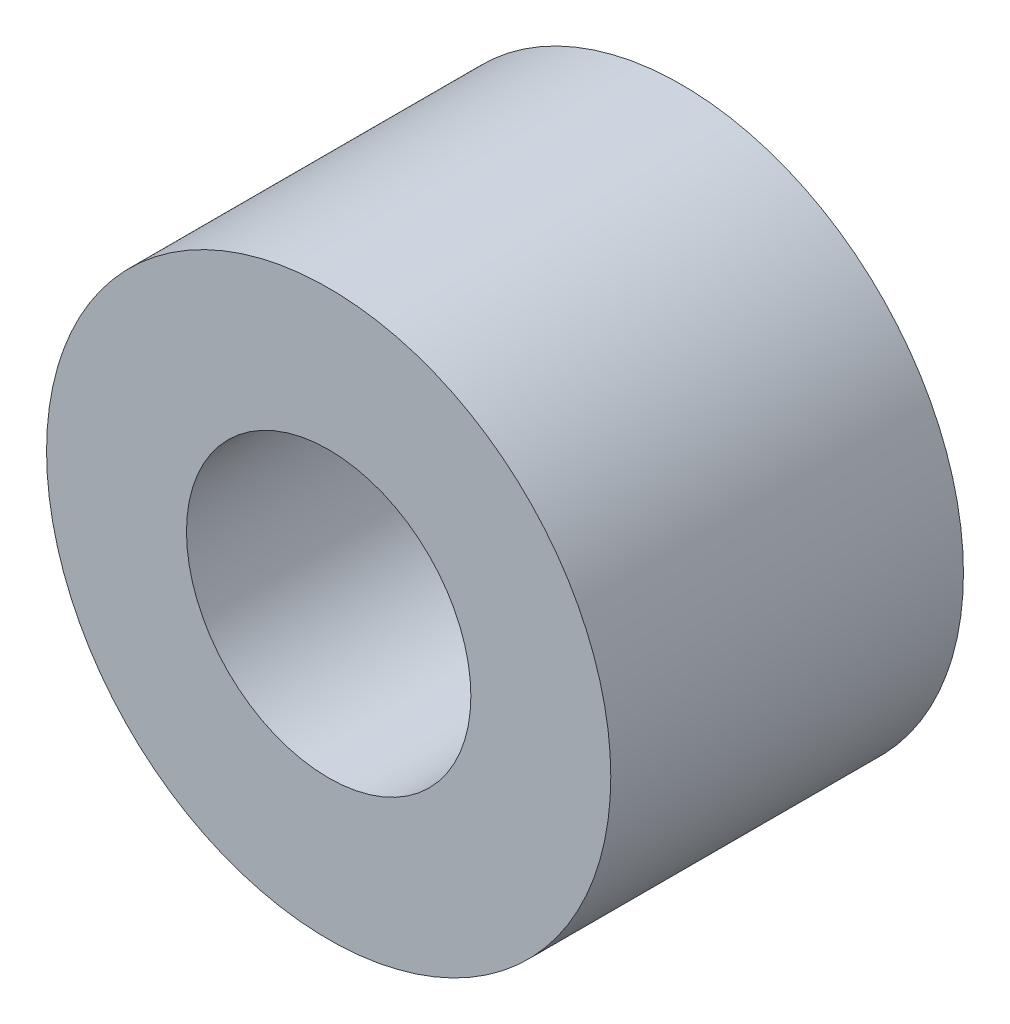
ISO-10303-21;
HEADER;
FILE_DESCRIPTION(('STEP AP214'),'2;1');
FILE_NAME('part.step','',(''),(''),'','','');
FILE_SCHEMA(('AUTOMOTIVE_DESIGN { 1 0 10303 214 1 1 1 1 }'));
ENDSEC;
DATA;
#1=APPLICATION_CONTEXT('core data for automotive mechanical design processes');
#2=APPLICATION_PROTOCOL_DEFINITION('international standard','automotive_design',2000,#1);
#3=PRODUCT_CONTEXT('',#1,'mechanical');
#4=PRODUCT('Part','Part','',(#3));
#5=PRODUCT_RELATED_PRODUCT_CATEGORY('part','',(#4));
#6=PRODUCT_DEFINITION_FORMATION('','',#4);
#7=PRODUCT_DEFINITION_CONTEXT('part definition',#1,'design');
#8=PRODUCT_DEFINITION('design','',#6,#7);
#9=PRODUCT_DEFINITION_SHAPE('','',#8);
#10=(LENGTH_UNIT() NAMED_UNIT(*) SI_UNIT(.MILLI.,.METRE.));
#11=(NAMED_UNIT(*) PLANE_ANGLE_UNIT() SI_UNIT($,.RADIAN.));
#12=(NAMED_UNIT(*) SI_UNIT($,.STERADIAN.) SOLID_ANGLE_UNIT());
#13=UNCERTAINTY_MEASURE_WITH_UNIT(LENGTH_MEASURE(1.E-05),#10,'distance_accuracy_value','');
#14=(GEOMETRIC_REPRESENTATION_CONTEXT(3) GLOBAL_UNCERTAINTY_ASSIGNED_CONTEXT((#13)) GLOBAL_UNIT_ASSIGNED_CONTEXT((#10,
#11,#12)) REPRESENTATION_CONTEXT('',''));
#15=CARTESIAN_POINT('',(0.,0.,0.));
#16=DIRECTION('',(0.,0.,1.));
#17=DIRECTION('',(1.,0.,0.));
#18=AXIS2_PLACEMENT_3D('',#15,#16,#17);
#19=CARTESIAN_POINT('',(0.,0.,3.96875));
#20=DIRECTION('',(0.,0.,-1.));
#21=DIRECTION('',(-1.,0.,0.));
#22=AXIS2_PLACEMENT_3D('',#19,#20,#21);
#23=CYLINDRICAL_SURFACE('',#22,3.2004);
#24=CARTESIAN_POINT('',(0.,0.,-3.96875));
#25=DIRECTION('',(0.,0.,-1.));
#26=DIRECTION('',(-1.,0.,0.));
#27=AXIS2_PLACEMENT_3D('',#24,#25,#26);
#28=CIRCLE('',#27,3.2004);
#29=CARTESIAN_POINT('',(-3.2004,0.,-3.96875));
#30=VERTEX_POINT('',#29);
#31=EDGE_CURVE('E27',#30,#30,#28,.T.);
#32=ORIENTED_EDGE('',*,*,#31,.T.);
#33=EDGE_LOOP('',(#32));
#34=FACE_BOUND('',#33,.T.);
#35=CARTESIAN_POINT('',(0.,0.,3.96875));
#36=DIRECTION('',(0.,0.,-1.));
#37=DIRECTION('',(-1.,0.,0.));
#38=AXIS2_PLACEMENT_3D('',#35,#36,#37);
#39=CIRCLE('',#38,3.2004);
#40=CARTESIAN_POINT('',(-3.2004,0.,3.96875));
#41=VERTEX_POINT('',#40);
#42=EDGE_CURVE('E18',#41,#41,#39,.T.);
#43=ORIENTED_EDGE('',*,*,#42,.F.);
#44=EDGE_LOOP('',(#43));
#45=FACE_BOUND('',#44,.T.);
#46=ADVANCED_FACE('F15',(#34,#45),#23,.F.);
#47=CARTESIAN_POINT('',(0.,0.,3.96875));
#48=DIRECTION('',(0.,0.,1.));
#49=DIRECTION('',(1.,0.,0.));
#50=AXIS2_PLACEMENT_3D('',#47,#48,#49);
#51=PLANE('',#50);
#52=ORIENTED_EDGE('',*,*,#42,.T.);
#53=EDGE_LOOP('',(#52));
#54=FACE_BOUND('',#53,.T.);
#55=CARTESIAN_POINT('',(0.,0.,3.96875));
#56=DIRECTION('',(0.,0.,-1.));
#57=DIRECTION('',(-1.,0.,0.));
#58=AXIS2_PLACEMENT_3D('',#55,#56,#57);
#59=CIRCLE('',#58,6.35);
#60=CARTESIAN_POINT('',(-6.35,0.,3.96875));
#61=VERTEX_POINT('',#60);
#62=EDGE_CURVE('E22',#61,#61,#59,.T.);
#63=ORIENTED_EDGE('',*,*,#62,.F.);
#64=EDGE_LOOP('',(#63));
#65=FACE_BOUND('',#64,.T.);
#66=ADVANCED_FACE('F35',(#54,#65),#51,.T.);
#67=CARTESIAN_POINT('',(0.,0.,-3.96875));
#68=DIRECTION('',(0.,0.,1.));
#69=DIRECTION('',(1.,0.,0.));
#70=AXIS2_PLACEMENT_3D('',#67,#68,#69);
#71=PLANE('',#70);
#72=ORIENTED_EDGE('',*,*,#31,.F.);
#73=EDGE_LOOP('',(#72));
#74=FACE_BOUND('',#73,.T.);
#75=CARTESIAN_POINT('',(0.,0.,-3.96875));
#76=DIRECTION('',(0.,0.,-1.));
#77=DIRECTION('',(-1.,0.,0.));
#78=AXIS2_PLACEMENT_3D('',#75,#76,#77);
#79=CIRCLE('',#78,6.35);
#80=CARTESIAN_POINT('',(-6.35,0.,-3.96875));
#81=VERTEX_POINT('',#80);
#82=EDGE_CURVE('E10',#81,#81,#79,.F.);
#83=ORIENTED_EDGE('',*,*,#82,.F.);
#84=EDGE_LOOP('',(#83));
#85=FACE_BOUND('',#84,.T.);
#86=ADVANCED_FACE('F43',(#74,#85),#71,.F.);
#87=CARTESIAN_POINT('',(0.,0.,3.96875));
#88=DIRECTION('',(0.,0.,-1.));
#89=DIRECTION('',(-1.,0.,0.));
#90=AXIS2_PLACEMENT_3D('',#87,#88,#89);
#91=CYLINDRICAL_SURFACE('',#90,6.35);
#92=ORIENTED_EDGE('',*,*,#82,.T.);
#93=EDGE_LOOP('',(#92));
#94=FACE_BOUND('',#93,.T.);
#95=ORIENTED_EDGE('',*,*,#62,.T.);
#96=EDGE_LOOP('',(#95));
#97=FACE_BOUND('',#96,.T.);
#98=ADVANCED_FACE('F44',(#94,#97),#91,.T.);
#99=CLOSED_SHELL('',(#46,#66,#86,#98));
#100=MANIFOLD_SOLID_BREP('B1',#99);
#101=ADVANCED_BREP_SHAPE_REPRESENTATION('',(#18,#100),#14);
#102=SHAPE_DEFINITION_REPRESENTATION(#9,#101);
ENDSEC;
END-ISO-10303-21;
